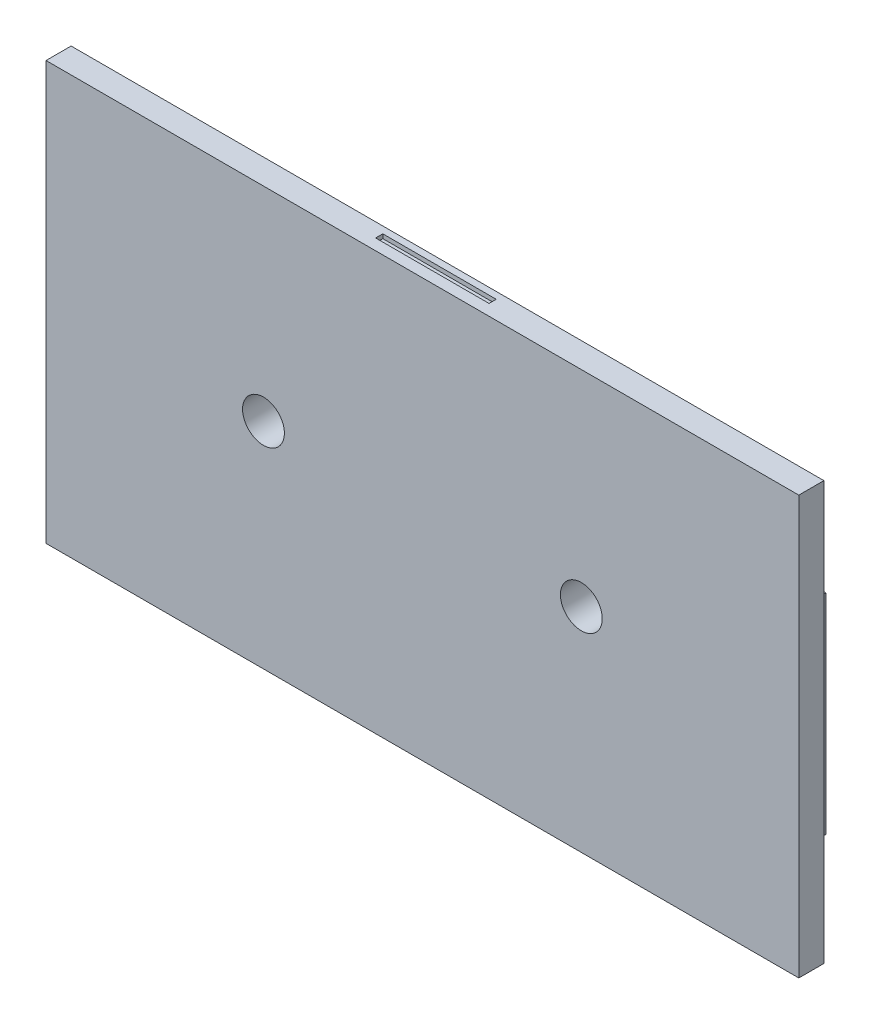
ISO-10303-21;
HEADER;
FILE_DESCRIPTION(('STEP AP214'),'2;1');
FILE_NAME('part.step','',(''),(''),'','','');
FILE_SCHEMA(('AUTOMOTIVE_DESIGN { 1 0 10303 214 1 1 1 1 }'));
ENDSEC;
DATA;
#1=APPLICATION_CONTEXT('core data for automotive mechanical design processes');
#2=APPLICATION_PROTOCOL_DEFINITION('international standard','automotive_design',2000,#1);
#3=PRODUCT_CONTEXT('',#1,'mechanical');
#4=PRODUCT('Part','Part','',(#3));
#5=PRODUCT_RELATED_PRODUCT_CATEGORY('part','',(#4));
#6=PRODUCT_DEFINITION_FORMATION('','',#4);
#7=PRODUCT_DEFINITION_CONTEXT('part definition',#1,'design');
#8=PRODUCT_DEFINITION('design','',#6,#7);
#9=PRODUCT_DEFINITION_SHAPE('','',#8);
#10=(LENGTH_UNIT() NAMED_UNIT(*) SI_UNIT(.MILLI.,.METRE.));
#11=(NAMED_UNIT(*) PLANE_ANGLE_UNIT() SI_UNIT($,.RADIAN.));
#12=(NAMED_UNIT(*) SI_UNIT($,.STERADIAN.) SOLID_ANGLE_UNIT());
#13=UNCERTAINTY_MEASURE_WITH_UNIT(LENGTH_MEASURE(1.E-05),#10,'distance_accuracy_value','');
#14=(GEOMETRIC_REPRESENTATION_CONTEXT(3) GLOBAL_UNCERTAINTY_ASSIGNED_CONTEXT((#13)) GLOBAL_UNIT_ASSIGNED_CONTEXT((#10,
#11,#12)) REPRESENTATION_CONTEXT('',''));
#15=CARTESIAN_POINT('',(0.,0.,0.));
#16=DIRECTION('',(0.,0.,1.));
#17=DIRECTION('',(1.,0.,0.));
#18=AXIS2_PLACEMENT_3D('',#15,#16,#17);
#19=CARTESIAN_POINT('',(0.,0.,0.));
#20=DIRECTION('',(0.,0.,-1.));
#21=DIRECTION('',(-1.,0.,0.));
#22=AXIS2_PLACEMENT_3D('',#19,#20,#21);
#23=PLANE('',#22);
#24=DIRECTION('',(1.,0.,0.));
#25=VECTOR('',#24,1.);
#26=CARTESIAN_POINT('',(90.,-50.,0.));
#27=LINE('',#26,#25);
#28=CARTESIAN_POINT('',(-90.,-50.,0.));
#29=VERTEX_POINT('',#28);
#30=CARTESIAN_POINT('',(90.,-50.,0.));
#31=VERTEX_POINT('',#30);
#32=EDGE_CURVE('E381',#29,#31,#27,.T.);
#33=ORIENTED_EDGE('',*,*,#32,.F.);
#34=DIRECTION('',(0.,-1.,0.));
#35=VECTOR('',#34,1.);
#36=CARTESIAN_POINT('',(-90.,-50.,0.));
#37=LINE('',#36,#35);
#38=CARTESIAN_POINT('',(-90.,50.,0.));
#39=VERTEX_POINT('',#38);
#40=EDGE_CURVE('E386',#39,#29,#37,.T.);
#41=ORIENTED_EDGE('',*,*,#40,.F.);
#42=DIRECTION('',(-1.,0.,0.));
#43=VECTOR('',#42,1.);
#44=CARTESIAN_POINT('',(-90.,50.,0.));
#45=LINE('',#44,#43);
#46=CARTESIAN_POINT('',(90.,50.,0.));
#47=VERTEX_POINT('',#46);
#48=EDGE_CURVE('E402',#47,#39,#45,.T.);
#49=ORIENTED_EDGE('',*,*,#48,.F.);
#50=DIRECTION('',(0.,1.,0.));
#51=VECTOR('',#50,1.);
#52=CARTESIAN_POINT('',(90.,50.,0.));
#53=LINE('',#52,#51);
#54=EDGE_CURVE('E399',#31,#47,#53,.T.);
#55=ORIENTED_EDGE('',*,*,#54,.F.);
#56=EDGE_LOOP('',(#33,#41,#49,#55));
#57=FACE_BOUND('',#56,.T.);
#58=DIRECTION('',(0.,1.,0.));
#59=VECTOR('',#58,1.);
#60=CARTESIAN_POINT('',(85.,-45.,0.));
#61=LINE('',#60,#59);
#62=CARTESIAN_POINT('',(85.,-45.,0.));
#63=VERTEX_POINT('',#62);
#64=CARTESIAN_POINT('',(85.,45.,0.));
#65=VERTEX_POINT('',#64);
#66=EDGE_CURVE('E365',#63,#65,#61,.T.);
#67=ORIENTED_EDGE('',*,*,#66,.T.);
#68=DIRECTION('',(-1.,0.,0.));
#69=VECTOR('',#68,1.);
#70=CARTESIAN_POINT('',(85.,45.,0.));
#71=LINE('',#70,#69);
#72=CARTESIAN_POINT('',(-85.,45.,0.));
#73=VERTEX_POINT('',#72);
#74=EDGE_CURVE('E353',#65,#73,#71,.T.);
#75=ORIENTED_EDGE('',*,*,#74,.T.);
#76=DIRECTION('',(0.,-1.,0.));
#77=VECTOR('',#76,1.);
#78=CARTESIAN_POINT('',(-85.,45.,0.));
#79=LINE('',#78,#77);
#80=CARTESIAN_POINT('',(-85.,-45.,0.));
#81=VERTEX_POINT('',#80);
#82=EDGE_CURVE('E357',#73,#81,#79,.T.);
#83=ORIENTED_EDGE('',*,*,#82,.T.);
#84=DIRECTION('',(1.,0.,0.));
#85=VECTOR('',#84,1.);
#86=CARTESIAN_POINT('',(-85.,-45.,0.));
#87=LINE('',#86,#85);
#88=EDGE_CURVE('E361',#81,#63,#87,.T.);
#89=ORIENTED_EDGE('',*,*,#88,.T.);
#90=EDGE_LOOP('',(#67,#75,#83,#89));
#91=FACE_BOUND('',#90,.T.);
#92=DIRECTION('',(-1.,0.,0.));
#93=VECTOR('',#92,1.);
#94=CARTESIAN_POINT('',(88.5,-25.,0.));
#95=LINE('',#94,#93);
#96=CARTESIAN_POINT('',(88.5,-25.,0.));
#97=VERTEX_POINT('',#96);
#98=CARTESIAN_POINT('',(86.5,-25.,0.));
#99=VERTEX_POINT('',#98);
#100=EDGE_CURVE('E302',#97,#99,#95,.T.);
#101=ORIENTED_EDGE('',*,*,#100,.F.);
#102=DIRECTION('',(0.,-1.,0.));
#103=VECTOR('',#102,1.);
#104=CARTESIAN_POINT('',(88.5,25.,0.));
#105=LINE('',#104,#103);
#106=CARTESIAN_POINT('',(88.5,25.,0.));
#107=VERTEX_POINT('',#106);
#108=EDGE_CURVE('E283',#107,#97,#105,.T.);
#109=ORIENTED_EDGE('',*,*,#108,.F.);
#110=DIRECTION('',(1.,0.,0.));
#111=VECTOR('',#110,1.);
#112=CARTESIAN_POINT('',(88.5,25.,0.));
#113=LINE('',#112,#111);
#114=CARTESIAN_POINT('',(86.5,25.,0.));
#115=VERTEX_POINT('',#114);
#116=EDGE_CURVE('E289',#115,#107,#113,.T.);
#117=ORIENTED_EDGE('',*,*,#116,.F.);
#118=DIRECTION('',(0.,1.,0.));
#119=VECTOR('',#118,1.);
#120=CARTESIAN_POINT('',(86.5,25.,0.));
#121=LINE('',#120,#119);
#122=EDGE_CURVE('E305',#99,#115,#121,.T.);
#123=ORIENTED_EDGE('',*,*,#122,.F.);
#124=EDGE_LOOP('',(#101,#109,#117,#123));
#125=FACE_BOUND('',#124,.T.);
#126=DIRECTION('',(-1.,0.,0.));
#127=VECTOR('',#126,1.);
#128=CARTESIAN_POINT('',(-88.5,25.,0.));
#129=LINE('',#128,#127);
#130=CARTESIAN_POINT('',(-86.5,25.,0.));
#131=VERTEX_POINT('',#130);
#132=CARTESIAN_POINT('',(-88.5,25.,0.));
#133=VERTEX_POINT('',#132);
#134=EDGE_CURVE('E242',#131,#133,#129,.T.);
#135=ORIENTED_EDGE('',*,*,#134,.T.);
#136=DIRECTION('',(0.,-1.,0.));
#137=VECTOR('',#136,1.);
#138=CARTESIAN_POINT('',(-88.5,25.,0.));
#139=LINE('',#138,#137);
#140=CARTESIAN_POINT('',(-88.5,-25.,0.));
#141=VERTEX_POINT('',#140);
#142=EDGE_CURVE('E69',#133,#141,#139,.T.);
#143=ORIENTED_EDGE('',*,*,#142,.T.);
#144=DIRECTION('',(1.,0.,0.));
#145=VECTOR('',#144,1.);
#146=CARTESIAN_POINT('',(-88.5,-25.,0.));
#147=LINE('',#146,#145);
#148=CARTESIAN_POINT('',(-86.5,-25.,0.));
#149=VERTEX_POINT('',#148);
#150=EDGE_CURVE('E274',#141,#149,#147,.T.);
#151=ORIENTED_EDGE('',*,*,#150,.T.);
#152=DIRECTION('',(0.,1.,0.));
#153=VECTOR('',#152,1.);
#154=CARTESIAN_POINT('',(-86.5,25.,0.));
#155=LINE('',#154,#153);
#156=EDGE_CURVE('E267',#149,#131,#155,.T.);
#157=ORIENTED_EDGE('',*,*,#156,.T.);
#158=EDGE_LOOP('',(#135,#143,#151,#157));
#159=FACE_BOUND('',#158,.T.);
#160=ADVANCED_FACE('F45',(#57,#91,#125,#159),#23,.T.);
#161=CARTESIAN_POINT('',(85.,45.,6.));
#162=DIRECTION('',(0.,-1.,0.));
#163=DIRECTION('',(1.,0.,0.));
#164=AXIS2_PLACEMENT_3D('',#161,#162,#163);
#165=PLANE('',#164);
#166=DIRECTION('',(0.,0.,-1.));
#167=VECTOR('',#166,1.);
#168=CARTESIAN_POINT('',(85.,45.,6.));
#169=LINE('',#168,#167);
#170=CARTESIAN_POINT('',(85.,45.,5.15));
#171=VERTEX_POINT('',#170);
#172=EDGE_CURVE('E369',#171,#65,#169,.T.);
#173=ORIENTED_EDGE('',*,*,#172,.F.);
#174=DIRECTION('',(-1.,0.,0.));
#175=VECTOR('',#174,1.);
#176=CARTESIAN_POINT('',(85.,45.,5.15));
#177=LINE('',#176,#175);
#178=CARTESIAN_POINT('',(-85.,45.,5.15));
#179=VERTEX_POINT('',#178);
#180=EDGE_CURVE('E349',#171,#179,#177,.T.);
#181=ORIENTED_EDGE('',*,*,#180,.T.);
#182=DIRECTION('',(0.,0.,-1.));
#183=VECTOR('',#182,1.);
#184=CARTESIAN_POINT('',(-85.,45.,6.));
#185=LINE('',#184,#183);
#186=EDGE_CURVE('E378',#179,#73,#185,.T.);
#187=ORIENTED_EDGE('',*,*,#186,.T.);
#188=ORIENTED_EDGE('',*,*,#74,.F.);
#189=EDGE_LOOP('',(#173,#181,#187,#188));
#190=FACE_BOUND('',#189,.T.);
#191=ADVANCED_FACE('F469',(#190),#165,.T.);
#192=CARTESIAN_POINT('',(-85.,45.,6.));
#193=DIRECTION('',(1.,0.,0.));
#194=DIRECTION('',(0.,0.,-1.));
#195=AXIS2_PLACEMENT_3D('',#192,#193,#194);
#196=PLANE('',#195);
#197=ORIENTED_EDGE('',*,*,#186,.F.);
#198=DIRECTION('',(0.,1.,0.));
#199=VECTOR('',#198,1.);
#200=CARTESIAN_POINT('',(-85.,50.,5.15));
#201=LINE('',#200,#199);
#202=CARTESIAN_POINT('',(-85.,-45.,5.14999999999999));
#203=VERTEX_POINT('',#202);
#204=EDGE_CURVE('E342',#203,#179,#201,.T.);
#205=ORIENTED_EDGE('',*,*,#204,.F.);
#206=DIRECTION('',(0.,0.,-1.));
#207=VECTOR('',#206,1.);
#208=CARTESIAN_POINT('',(-85.,-45.,6.));
#209=LINE('',#208,#207);
#210=EDGE_CURVE('E375',#203,#81,#209,.T.);
#211=ORIENTED_EDGE('',*,*,#210,.T.);
#212=ORIENTED_EDGE('',*,*,#82,.F.);
#213=EDGE_LOOP('',(#197,#205,#211,#212));
#214=FACE_BOUND('',#213,.T.);
#215=ADVANCED_FACE('F477',(#214),#196,.T.);
#216=CARTESIAN_POINT('',(-85.,-45.,6.));
#217=DIRECTION('',(0.,1.,0.));
#218=DIRECTION('',(-1.,0.,0.));
#219=AXIS2_PLACEMENT_3D('',#216,#217,#218);
#220=PLANE('',#219);
#221=ORIENTED_EDGE('',*,*,#210,.F.);
#222=DIRECTION('',(1.,0.,0.));
#223=VECTOR('',#222,1.);
#224=CARTESIAN_POINT('',(-85.,-45.,5.14999999999999));
#225=LINE('',#224,#223);
#226=CARTESIAN_POINT('',(85.,-45.,5.14999999999999));
#227=VERTEX_POINT('',#226);
#228=EDGE_CURVE('E345',#203,#227,#225,.T.);
#229=ORIENTED_EDGE('',*,*,#228,.T.);
#230=DIRECTION('',(0.,0.,-1.));
#231=VECTOR('',#230,1.);
#232=CARTESIAN_POINT('',(85.,-45.,6.));
#233=LINE('',#232,#231);
#234=EDGE_CURVE('E372',#227,#63,#233,.T.);
#235=ORIENTED_EDGE('',*,*,#234,.T.);
#236=ORIENTED_EDGE('',*,*,#88,.F.);
#237=EDGE_LOOP('',(#221,#229,#235,#236));
#238=FACE_BOUND('',#237,.T.);
#239=ADVANCED_FACE('F518',(#238),#220,.T.);
#240=CARTESIAN_POINT('',(85.,-45.,6.));
#241=DIRECTION('',(-1.,0.,0.));
#242=DIRECTION('',(0.,0.,1.));
#243=AXIS2_PLACEMENT_3D('',#240,#241,#242);
#244=PLANE('',#243);
#245=ORIENTED_EDGE('',*,*,#234,.F.);
#246=DIRECTION('',(0.,1.,0.));
#247=VECTOR('',#246,1.);
#248=CARTESIAN_POINT('',(85.,-45.,5.14999999999999));
#249=LINE('',#248,#247);
#250=EDGE_CURVE('E422',#227,#171,#249,.T.);
#251=ORIENTED_EDGE('',*,*,#250,.T.);
#252=ORIENTED_EDGE('',*,*,#172,.T.);
#253=ORIENTED_EDGE('',*,*,#66,.F.);
#254=EDGE_LOOP('',(#245,#251,#252,#253));
#255=FACE_BOUND('',#254,.T.);
#256=ADVANCED_FACE('F511',(#255),#244,.T.);
#257=CARTESIAN_POINT('',(0.,0.,6.));
#258=DIRECTION('',(0.,0.,-1.));
#259=DIRECTION('',(-1.,0.,0.));
#260=AXIS2_PLACEMENT_3D('',#257,#258,#259);
#261=PLANE('',#260);
#262=CARTESIAN_POINT('',(38.,0.899999999999983,6.));
#263=DIRECTION('',(0.,0.,-1.));
#264=DIRECTION('',(-1.,0.,0.));
#265=AXIS2_PLACEMENT_3D('',#262,#263,#264);
#266=CIRCLE('',#265,5.00000000000002);
#267=CARTESIAN_POINT('',(33.,0.899999999999983,6.));
#268=VERTEX_POINT('',#267);
#269=EDGE_CURVE('E330',#268,#268,#266,.T.);
#270=ORIENTED_EDGE('',*,*,#269,.T.);
#271=EDGE_LOOP('',(#270));
#272=FACE_BOUND('',#271,.T.);
#273=CARTESIAN_POINT('',(-38.,1.29999999999999,6.));
#274=DIRECTION('',(0.,0.,-1.));
#275=DIRECTION('',(-1.,0.,0.));
#276=AXIS2_PLACEMENT_3D('',#273,#274,#275);
#277=CIRCLE('',#276,5.);
#278=CARTESIAN_POINT('',(-43.,1.29999999999999,6.));
#279=VERTEX_POINT('',#278);
#280=EDGE_CURVE('E324',#279,#279,#277,.T.);
#281=ORIENTED_EDGE('',*,*,#280,.T.);
#282=EDGE_LOOP('',(#281));
#283=FACE_BOUND('',#282,.T.);
#284=DIRECTION('',(1.,0.,0.));
#285=VECTOR('',#284,1.);
#286=CARTESIAN_POINT('',(90.,-50.,6.));
#287=LINE('',#286,#285);
#288=CARTESIAN_POINT('',(-90.,-50.,6.));
#289=VERTEX_POINT('',#288);
#290=CARTESIAN_POINT('',(90.,-50.,6.));
#291=VERTEX_POINT('',#290);
#292=EDGE_CURVE('E382',#289,#291,#287,.T.);
#293=ORIENTED_EDGE('',*,*,#292,.T.);
#294=DIRECTION('',(0.,1.,0.));
#295=VECTOR('',#294,1.);
#296=CARTESIAN_POINT('',(90.,50.,6.));
#297=LINE('',#296,#295);
#298=CARTESIAN_POINT('',(90.,50.,6.));
#299=VERTEX_POINT('',#298);
#300=EDGE_CURVE('E385',#291,#299,#297,.T.);
#301=ORIENTED_EDGE('',*,*,#300,.T.);
#302=DIRECTION('',(-1.,0.,0.));
#303=VECTOR('',#302,1.);
#304=CARTESIAN_POINT('',(-90.,50.,6.));
#305=LINE('',#304,#303);
#306=CARTESIAN_POINT('',(-90.,50.,6.));
#307=VERTEX_POINT('',#306);
#308=EDGE_CURVE('E389',#299,#307,#305,.T.);
#309=ORIENTED_EDGE('',*,*,#308,.T.);
#310=DIRECTION('',(0.,-1.,0.));
#311=VECTOR('',#310,1.);
#312=CARTESIAN_POINT('',(-90.,-50.,6.));
#313=LINE('',#312,#311);
#314=EDGE_CURVE('E392',#307,#289,#313,.T.);
#315=ORIENTED_EDGE('',*,*,#314,.T.);
#316=EDGE_LOOP('',(#293,#301,#309,#315));
#317=FACE_BOUND('',#316,.T.);
#318=ADVANCED_FACE('F484',(#272,#283,#317),#261,.F.);
#319=CARTESIAN_POINT('',(90.,-50.,6.));
#320=DIRECTION('',(0.,1.,0.));
#321=DIRECTION('',(0.,0.,1.));
#322=AXIS2_PLACEMENT_3D('',#319,#320,#321);
#323=PLANE('',#322);
#324=DIRECTION('',(0.,0.,-1.));
#325=VECTOR('',#324,1.);
#326=CARTESIAN_POINT('',(90.,-50.,6.));
#327=LINE('',#326,#325);
#328=EDGE_CURVE('E418',#291,#31,#327,.T.);
#329=ORIENTED_EDGE('',*,*,#328,.F.);
#330=ORIENTED_EDGE('',*,*,#292,.F.);
#331=DIRECTION('',(0.,0.,-1.));
#332=VECTOR('',#331,1.);
#333=CARTESIAN_POINT('',(-90.,-50.,6.));
#334=LINE('',#333,#332);
#335=EDGE_CURVE('E395',#289,#29,#334,.T.);
#336=ORIENTED_EDGE('',*,*,#335,.T.);
#337=ORIENTED_EDGE('',*,*,#32,.T.);
#338=EDGE_LOOP('',(#329,#330,#336,#337));
#339=FACE_BOUND('',#338,.T.);
#340=ADVANCED_FACE('F47',(#339),#323,.F.);
#341=CARTESIAN_POINT('',(90.,50.,6.));
#342=DIRECTION('',(-1.,0.,0.));
#343=DIRECTION('',(0.,0.,1.));
#344=AXIS2_PLACEMENT_3D('',#341,#342,#343);
#345=PLANE('',#344);
#346=ORIENTED_EDGE('',*,*,#54,.T.);
#347=DIRECTION('',(0.,0.,-1.));
#348=VECTOR('',#347,1.);
#349=CARTESIAN_POINT('',(90.,50.,6.));
#350=LINE('',#349,#348);
#351=EDGE_CURVE('E414',#299,#47,#350,.T.);
#352=ORIENTED_EDGE('',*,*,#351,.F.);
#353=ORIENTED_EDGE('',*,*,#300,.F.);
#354=ORIENTED_EDGE('',*,*,#328,.T.);
#355=EDGE_LOOP('',(#346,#352,#353,#354));
#356=FACE_BOUND('',#355,.T.);
#357=ADVANCED_FACE('F490',(#356),#345,.F.);
#358=CARTESIAN_POINT('',(-90.,50.,6.));
#359=DIRECTION('',(0.,-1.,0.));
#360=DIRECTION('',(0.,0.,-1.));
#361=AXIS2_PLACEMENT_3D('',#358,#359,#360);
#362=PLANE('',#361);
#363=DIRECTION('',(1.,0.,0.));
#364=VECTOR('',#363,1.);
#365=CARTESIAN_POINT('',(13.2691884195042,50.,3.3433918285293));
#366=LINE('',#365,#364);
#367=CARTESIAN_POINT('',(-13.8419591426482,50.,3.3433918285293));
#368=VERTEX_POINT('',#367);
#369=CARTESIAN_POINT('',(13.2691884195042,50.,3.3433918285293));
#370=VERTEX_POINT('',#369);
#371=EDGE_CURVE('E220',#368,#370,#366,.T.);
#372=ORIENTED_EDGE('',*,*,#371,.F.);
#373=DIRECTION('',(0.,0.,1.));
#374=VECTOR('',#373,1.);
#375=CARTESIAN_POINT('',(-13.8419591426482,50.,3.3433918285293));
#376=LINE('',#375,#374);
#377=CARTESIAN_POINT('',(-13.8419591426482,50.,1.62507965909711));
#378=VERTEX_POINT('',#377);
#379=EDGE_CURVE('E61',#378,#368,#376,.T.);
#380=ORIENTED_EDGE('',*,*,#379,.F.);
#381=DIRECTION('',(-1.,0.,0.));
#382=VECTOR('',#381,1.);
#383=CARTESIAN_POINT('',(-13.8419591426482,50.,1.62507965909711));
#384=LINE('',#383,#382);
#385=CARTESIAN_POINT('',(13.2691884195042,50.,1.62507965909711));
#386=VERTEX_POINT('',#385);
#387=EDGE_CURVE('E207',#386,#378,#384,.T.);
#388=ORIENTED_EDGE('',*,*,#387,.F.);
#389=DIRECTION('',(0.,0.,-1.));
#390=VECTOR('',#389,1.);
#391=CARTESIAN_POINT('',(13.2691884195042,50.,1.62507965909711));
#392=LINE('',#391,#390);
#393=EDGE_CURVE('E211',#370,#386,#392,.T.);
#394=ORIENTED_EDGE('',*,*,#393,.F.);
#395=EDGE_LOOP('',(#372,#380,#388,#394));
#396=FACE_BOUND('',#395,.T.);
#397=DIRECTION('',(0.,0.,-1.));
#398=VECTOR('',#397,1.);
#399=CARTESIAN_POINT('',(-90.,50.,6.));
#400=LINE('',#399,#398);
#401=EDGE_CURVE('E410',#307,#39,#400,.T.);
#402=ORIENTED_EDGE('',*,*,#401,.F.);
#403=ORIENTED_EDGE('',*,*,#308,.F.);
#404=ORIENTED_EDGE('',*,*,#351,.T.);
#405=ORIENTED_EDGE('',*,*,#48,.T.);
#406=EDGE_LOOP('',(#402,#403,#404,#405));
#407=FACE_BOUND('',#406,.T.);
#408=ADVANCED_FACE('F487',(#396,#407),#362,.F.);
#409=CARTESIAN_POINT('',(-90.,-50.,6.));
#410=DIRECTION('',(1.,0.,0.));
#411=DIRECTION('',(0.,0.,-1.));
#412=AXIS2_PLACEMENT_3D('',#409,#410,#411);
#413=PLANE('',#412);
#414=ORIENTED_EDGE('',*,*,#40,.T.);
#415=ORIENTED_EDGE('',*,*,#335,.F.);
#416=ORIENTED_EDGE('',*,*,#314,.F.);
#417=ORIENTED_EDGE('',*,*,#401,.T.);
#418=EDGE_LOOP('',(#414,#415,#416,#417));
#419=FACE_BOUND('',#418,.T.);
#420=ADVANCED_FACE('F465',(#419),#413,.F.);
#421=CARTESIAN_POINT('',(185.003612434752,50.,5.15));
#422=DIRECTION('',(0.,0.,1.));
#423=DIRECTION('',(0.,-1.,0.));
#424=AXIS2_PLACEMENT_3D('',#421,#422,#423);
#425=PLANE('',#424);
#426=CARTESIAN_POINT('',(-38.,1.29999999999999,5.14999999999999));
#427=DIRECTION('',(0.,0.,1.));
#428=DIRECTION('',(0.,-1.,0.));
#429=AXIS2_PLACEMENT_3D('',#426,#427,#428);
#430=CIRCLE('',#429,12.5);
#431=CARTESIAN_POINT('',(-38.,-11.2,5.14999999999999));
#432=VERTEX_POINT('',#431);
#433=EDGE_CURVE('E430',#432,#432,#430,.F.);
#434=ORIENTED_EDGE('',*,*,#433,.F.);
#435=EDGE_LOOP('',(#434));
#436=FACE_BOUND('',#435,.T.);
#437=CARTESIAN_POINT('',(38.,0.899999999999983,5.14999999999999));
#438=DIRECTION('',(0.,0.,1.));
#439=DIRECTION('',(0.,-1.,0.));
#440=AXIS2_PLACEMENT_3D('',#437,#438,#439);
#441=CIRCLE('',#440,12.5);
#442=CARTESIAN_POINT('',(38.,-11.6,5.14999999999999));
#443=VERTEX_POINT('',#442);
#444=EDGE_CURVE('E426',#443,#443,#441,.F.);
#445=ORIENTED_EDGE('',*,*,#444,.F.);
#446=EDGE_LOOP('',(#445));
#447=FACE_BOUND('',#446,.T.);
#448=ORIENTED_EDGE('',*,*,#180,.F.);
#449=ORIENTED_EDGE('',*,*,#250,.F.);
#450=ORIENTED_EDGE('',*,*,#228,.F.);
#451=ORIENTED_EDGE('',*,*,#204,.T.);
#452=EDGE_LOOP('',(#448,#449,#450,#451));
#453=FACE_BOUND('',#452,.T.);
#454=ADVANCED_FACE('F456',(#436,#447,#453),#425,.F.);
#455=CARTESIAN_POINT('',(38.,0.899999999999985,-4.85000000000001));
#456=DIRECTION('',(0.,0.,-1.));
#457=DIRECTION('',(0.,1.,0.));
#458=AXIS2_PLACEMENT_3D('',#455,#456,#457);
#459=PLANE('',#458);
#460=CARTESIAN_POINT('',(38.,0.899999999999985,-4.85000000000001));
#461=DIRECTION('',(0.,0.,-1.));
#462=DIRECTION('',(0.,1.,0.));
#463=AXIS2_PLACEMENT_3D('',#460,#461,#462);
#464=CIRCLE('',#463,12.5);
#465=CARTESIAN_POINT('',(38.,13.4,-4.85));
#466=VERTEX_POINT('',#465);
#467=EDGE_CURVE('E338',#466,#466,#464,.T.);
#468=ORIENTED_EDGE('',*,*,#467,.T.);
#469=EDGE_LOOP('',(#468));
#470=FACE_BOUND('',#469,.T.);
#471=CARTESIAN_POINT('',(38.,0.899999999999985,-4.85000000000001));
#472=DIRECTION('',(0.,0.,-1.));
#473=DIRECTION('',(0.,1.,0.));
#474=AXIS2_PLACEMENT_3D('',#471,#472,#473);
#475=CIRCLE('',#474,9.24999999999999);
#476=CARTESIAN_POINT('',(38.,10.15,-4.85));
#477=VERTEX_POINT('',#476);
#478=EDGE_CURVE('E334',#477,#477,#475,.T.);
#479=ORIENTED_EDGE('',*,*,#478,.F.);
#480=EDGE_LOOP('',(#479));
#481=FACE_BOUND('',#480,.T.);
#482=ADVANCED_FACE('F454',(#470,#481),#459,.T.);
#483=CARTESIAN_POINT('',(38.,0.899999999999985,-4.85000000000001));
#484=DIRECTION('',(0.,0.,1.));
#485=DIRECTION('',(0.,-1.,0.));
#486=AXIS2_PLACEMENT_3D('',#483,#484,#485);
#487=CYLINDRICAL_SURFACE('',#486,12.5);
#488=ORIENTED_EDGE('',*,*,#467,.F.);
#489=EDGE_LOOP('',(#488));
#490=FACE_BOUND('',#489,.T.);
#491=ORIENTED_EDGE('',*,*,#444,.T.);
#492=EDGE_LOOP('',(#491));
#493=FACE_BOUND('',#492,.T.);
#494=ADVANCED_FACE('F450',(#490,#493),#487,.T.);
#495=CARTESIAN_POINT('',(38.,0.899999999999985,-4.85000000000001));
#496=DIRECTION('',(0.,0.,1.));
#497=DIRECTION('',(0.,-1.,0.));
#498=AXIS2_PLACEMENT_3D('',#495,#496,#497);
#499=CYLINDRICAL_SURFACE('',#498,9.24999999999999);
#500=CARTESIAN_POINT('',(38.,0.899999999999984,-3.35000000000001));
#501=DIRECTION('',(0.,0.,-1.));
#502=DIRECTION('',(0.,1.,0.));
#503=AXIS2_PLACEMENT_3D('',#500,#501,#502);
#504=CIRCLE('',#503,9.24999999999999);
#505=CARTESIAN_POINT('',(38.,10.15,-3.35000000000001));
#506=VERTEX_POINT('',#505);
#507=EDGE_CURVE('E54',#506,#506,#504,.T.);
#508=ORIENTED_EDGE('',*,*,#507,.F.);
#509=EDGE_LOOP('',(#508));
#510=FACE_BOUND('',#509,.T.);
#511=ORIENTED_EDGE('',*,*,#478,.T.);
#512=EDGE_LOOP('',(#511));
#513=FACE_BOUND('',#512,.T.);
#514=ADVANCED_FACE('F446',(#510,#513),#499,.F.);
#515=CARTESIAN_POINT('',(-38.,1.29999999999999,-4.85000000000001));
#516=DIRECTION('',(0.,0.,-1.));
#517=DIRECTION('',(0.,1.,0.));
#518=AXIS2_PLACEMENT_3D('',#515,#516,#517);
#519=PLANE('',#518);
#520=CARTESIAN_POINT('',(-38.,1.29999999999999,-4.85000000000001));
#521=DIRECTION('',(0.,0.,-1.));
#522=DIRECTION('',(0.,1.,0.));
#523=AXIS2_PLACEMENT_3D('',#520,#521,#522);
#524=CIRCLE('',#523,12.5);
#525=CARTESIAN_POINT('',(-38.,13.8,-4.85));
#526=VERTEX_POINT('',#525);
#527=EDGE_CURVE('E325',#526,#526,#524,.T.);
#528=ORIENTED_EDGE('',*,*,#527,.T.);
#529=EDGE_LOOP('',(#528));
#530=FACE_BOUND('',#529,.T.);
#531=CARTESIAN_POINT('',(-38.,1.29999999999999,-4.85000000000001));
#532=DIRECTION('',(0.,0.,-1.));
#533=DIRECTION('',(0.,1.,0.));
#534=AXIS2_PLACEMENT_3D('',#531,#532,#533);
#535=CIRCLE('',#534,9.24999999999999);
#536=CARTESIAN_POINT('',(-38.,10.55,-4.85));
#537=VERTEX_POINT('',#536);
#538=EDGE_CURVE('E329',#537,#537,#535,.T.);
#539=ORIENTED_EDGE('',*,*,#538,.F.);
#540=EDGE_LOOP('',(#539));
#541=FACE_BOUND('',#540,.T.);
#542=ADVANCED_FACE('F449',(#530,#541),#519,.T.);
#543=CARTESIAN_POINT('',(-38.,1.29999999999999,-4.85000000000001));
#544=DIRECTION('',(0.,0.,1.));
#545=DIRECTION('',(0.,-1.,0.));
#546=AXIS2_PLACEMENT_3D('',#543,#544,#545);
#547=CYLINDRICAL_SURFACE('',#546,12.5);
#548=ORIENTED_EDGE('',*,*,#527,.F.);
#549=EDGE_LOOP('',(#548));
#550=FACE_BOUND('',#549,.T.);
#551=ORIENTED_EDGE('',*,*,#433,.T.);
#552=EDGE_LOOP('',(#551));
#553=FACE_BOUND('',#552,.T.);
#554=ADVANCED_FACE('F585',(#550,#553),#547,.T.);
#555=CARTESIAN_POINT('',(-38.,1.29999999999999,-4.85000000000001));
#556=DIRECTION('',(0.,0.,1.));
#557=DIRECTION('',(0.,-1.,0.));
#558=AXIS2_PLACEMENT_3D('',#555,#556,#557);
#559=CYLINDRICAL_SURFACE('',#558,9.24999999999999);
#560=CARTESIAN_POINT('',(-38.,1.29999999999999,-3.35000000000001));
#561=DIRECTION('',(0.,0.,-1.));
#562=DIRECTION('',(0.,1.,0.));
#563=AXIS2_PLACEMENT_3D('',#560,#561,#562);
#564=CIRCLE('',#563,9.24999999999999);
#565=CARTESIAN_POINT('',(-38.,10.55,-3.35000000000001));
#566=VERTEX_POINT('',#565);
#567=EDGE_CURVE('E11',#566,#566,#564,.T.);
#568=ORIENTED_EDGE('',*,*,#567,.F.);
#569=EDGE_LOOP('',(#568));
#570=FACE_BOUND('',#569,.T.);
#571=ORIENTED_EDGE('',*,*,#538,.T.);
#572=EDGE_LOOP('',(#571));
#573=FACE_BOUND('',#572,.T.);
#574=ADVANCED_FACE('F529',(#570,#573),#559,.F.);
#575=CARTESIAN_POINT('',(-38.,1.29999999999999,35.15));
#576=DIRECTION('',(0.,0.,-1.));
#577=DIRECTION('',(0.,1.,0.));
#578=AXIS2_PLACEMENT_3D('',#575,#576,#577);
#579=CYLINDRICAL_SURFACE('',#578,5.);
#580=ORIENTED_EDGE('',*,*,#280,.F.);
#581=EDGE_LOOP('',(#580));
#582=FACE_BOUND('',#581,.T.);
#583=CARTESIAN_POINT('',(-38.,1.29999999999999,-3.35000000000001));
#584=DIRECTION('',(0.,0.,-1.));
#585=DIRECTION('',(0.,1.,0.));
#586=AXIS2_PLACEMENT_3D('',#583,#584,#585);
#587=CIRCLE('',#586,5.);
#588=CARTESIAN_POINT('',(-38.,6.29999999999999,-3.35000000000001));
#589=VERTEX_POINT('',#588);
#590=EDGE_CURVE('E229',#589,#589,#587,.T.);
#591=ORIENTED_EDGE('',*,*,#590,.T.);
#592=EDGE_LOOP('',(#591));
#593=FACE_BOUND('',#592,.T.);
#594=ADVANCED_FACE('F525',(#582,#593),#579,.F.);
#595=CARTESIAN_POINT('',(38.,0.89999999999998,35.15));
#596=DIRECTION('',(0.,0.,-1.));
#597=DIRECTION('',(0.,1.,0.));
#598=AXIS2_PLACEMENT_3D('',#595,#596,#597);
#599=CYLINDRICAL_SURFACE('',#598,5.00000000000002);
#600=ORIENTED_EDGE('',*,*,#269,.F.);
#601=EDGE_LOOP('',(#600));
#602=FACE_BOUND('',#601,.T.);
#603=CARTESIAN_POINT('',(38.,0.899999999999985,-3.35000000000001));
#604=DIRECTION('',(0.,0.,-1.));
#605=DIRECTION('',(0.,1.,0.));
#606=AXIS2_PLACEMENT_3D('',#603,#604,#605);
#607=CIRCLE('',#606,5.00000000000002);
#608=CARTESIAN_POINT('',(38.,5.9,-3.35000000000001));
#609=VERTEX_POINT('',#608);
#610=EDGE_CURVE('E238',#609,#609,#607,.T.);
#611=ORIENTED_EDGE('',*,*,#610,.T.);
#612=EDGE_LOOP('',(#611));
#613=FACE_BOUND('',#612,.T.);
#614=ADVANCED_FACE('F528',(#602,#613),#599,.F.);
#615=CARTESIAN_POINT('',(88.5,25.,-2.));
#616=DIRECTION('',(-1.,0.,0.));
#617=DIRECTION('',(0.,0.,1.));
#618=AXIS2_PLACEMENT_3D('',#615,#616,#617);
#619=PLANE('',#618);
#620=ORIENTED_EDGE('',*,*,#108,.T.);
#621=DIRECTION('',(0.,0.,1.));
#622=VECTOR('',#621,1.);
#623=CARTESIAN_POINT('',(88.5,-25.,-2.));
#624=LINE('',#623,#622);
#625=CARTESIAN_POINT('',(88.5,-25.,-2.));
#626=VERTEX_POINT('',#625);
#627=EDGE_CURVE('E321',#626,#97,#624,.T.);
#628=ORIENTED_EDGE('',*,*,#627,.F.);
#629=DIRECTION('',(0.,-1.,0.));
#630=VECTOR('',#629,1.);
#631=CARTESIAN_POINT('',(88.5,25.,-2.));
#632=LINE('',#631,#630);
#633=CARTESIAN_POINT('',(88.5,25.,-2.));
#634=VERTEX_POINT('',#633);
#635=EDGE_CURVE('E284',#634,#626,#632,.T.);
#636=ORIENTED_EDGE('',*,*,#635,.F.);
#637=DIRECTION('',(0.,0.,1.));
#638=VECTOR('',#637,1.);
#639=CARTESIAN_POINT('',(88.5,25.,-2.));
#640=LINE('',#639,#638);
#641=EDGE_CURVE('E298',#634,#107,#640,.T.);
#642=ORIENTED_EDGE('',*,*,#641,.T.);
#643=EDGE_LOOP('',(#620,#628,#636,#642));
#644=FACE_BOUND('',#643,.T.);
#645=ADVANCED_FACE('F578',(#644),#619,.F.);
#646=CARTESIAN_POINT('',(88.5,-25.,-2.));
#647=DIRECTION('',(0.,1.,0.));
#648=DIRECTION('',(0.,0.,1.));
#649=AXIS2_PLACEMENT_3D('',#646,#647,#648);
#650=PLANE('',#649);
#651=ORIENTED_EDGE('',*,*,#100,.T.);
#652=DIRECTION('',(0.,0.,1.));
#653=VECTOR('',#652,1.);
#654=CARTESIAN_POINT('',(86.5,-25.,-2.));
#655=LINE('',#654,#653);
#656=CARTESIAN_POINT('',(86.5,-25.,-2.));
#657=VERTEX_POINT('',#656);
#658=EDGE_CURVE('E317',#657,#99,#655,.T.);
#659=ORIENTED_EDGE('',*,*,#658,.F.);
#660=DIRECTION('',(-1.,0.,0.));
#661=VECTOR('',#660,1.);
#662=CARTESIAN_POINT('',(88.5,-25.,-2.));
#663=LINE('',#662,#661);
#664=EDGE_CURVE('E288',#626,#657,#663,.T.);
#665=ORIENTED_EDGE('',*,*,#664,.F.);
#666=ORIENTED_EDGE('',*,*,#627,.T.);
#667=EDGE_LOOP('',(#651,#659,#665,#666));
#668=FACE_BOUND('',#667,.T.);
#669=ADVANCED_FACE('F574',(#668),#650,.F.);
#670=CARTESIAN_POINT('',(86.5,25.,-2.));
#671=DIRECTION('',(1.,0.,0.));
#672=DIRECTION('',(0.,0.,-1.));
#673=AXIS2_PLACEMENT_3D('',#670,#671,#672);
#674=PLANE('',#673);
#675=ORIENTED_EDGE('',*,*,#122,.T.);
#676=DIRECTION('',(0.,0.,1.));
#677=VECTOR('',#676,1.);
#678=CARTESIAN_POINT('',(86.5,25.,-2.));
#679=LINE('',#678,#677);
#680=CARTESIAN_POINT('',(86.5,25.,-2.));
#681=VERTEX_POINT('',#680);
#682=EDGE_CURVE('E314',#681,#115,#679,.T.);
#683=ORIENTED_EDGE('',*,*,#682,.F.);
#684=DIRECTION('',(0.,1.,0.));
#685=VECTOR('',#684,1.);
#686=CARTESIAN_POINT('',(86.5,25.,-2.));
#687=LINE('',#686,#685);
#688=EDGE_CURVE('E292',#657,#681,#687,.T.);
#689=ORIENTED_EDGE('',*,*,#688,.F.);
#690=ORIENTED_EDGE('',*,*,#658,.T.);
#691=EDGE_LOOP('',(#675,#683,#689,#690));
#692=FACE_BOUND('',#691,.T.);
#693=ADVANCED_FACE('F570',(#692),#674,.F.);
#694=CARTESIAN_POINT('',(88.5,25.,-2.));
#695=DIRECTION('',(0.,-1.,0.));
#696=DIRECTION('',(0.,0.,-1.));
#697=AXIS2_PLACEMENT_3D('',#694,#695,#696);
#698=PLANE('',#697);
#699=ORIENTED_EDGE('',*,*,#116,.T.);
#700=ORIENTED_EDGE('',*,*,#641,.F.);
#701=DIRECTION('',(1.,0.,0.));
#702=VECTOR('',#701,1.);
#703=CARTESIAN_POINT('',(88.5,25.,-2.));
#704=LINE('',#703,#702);
#705=EDGE_CURVE('E295',#681,#634,#704,.T.);
#706=ORIENTED_EDGE('',*,*,#705,.F.);
#707=ORIENTED_EDGE('',*,*,#682,.T.);
#708=EDGE_LOOP('',(#699,#700,#706,#707));
#709=FACE_BOUND('',#708,.T.);
#710=ADVANCED_FACE('F566',(#709),#698,.F.);
#711=CARTESIAN_POINT('',(0.,0.,-2.));
#712=DIRECTION('',(0.,0.,-1.));
#713=DIRECTION('',(-1.,0.,0.));
#714=AXIS2_PLACEMENT_3D('',#711,#712,#713);
#715=PLANE('',#714);
#716=ORIENTED_EDGE('',*,*,#635,.T.);
#717=ORIENTED_EDGE('',*,*,#664,.T.);
#718=ORIENTED_EDGE('',*,*,#688,.T.);
#719=ORIENTED_EDGE('',*,*,#705,.T.);
#720=EDGE_LOOP('',(#716,#717,#718,#719));
#721=FACE_BOUND('',#720,.T.);
#722=ADVANCED_FACE('F564',(#721),#715,.T.);
#723=CARTESIAN_POINT('',(-88.5,25.,-2.));
#724=DIRECTION('',(1.,0.,0.));
#725=DIRECTION('',(0.,0.,1.));
#726=AXIS2_PLACEMENT_3D('',#723,#724,#725);
#727=PLANE('',#726);
#728=ORIENTED_EDGE('',*,*,#142,.F.);
#729=DIRECTION('',(0.,0.,1.));
#730=VECTOR('',#729,1.);
#731=CARTESIAN_POINT('',(-88.5,25.,-2.));
#732=LINE('',#731,#730);
#733=CARTESIAN_POINT('',(-88.5,25.,-2.));
#734=VERTEX_POINT('',#733);
#735=EDGE_CURVE('E261',#734,#133,#732,.T.);
#736=ORIENTED_EDGE('',*,*,#735,.F.);
#737=DIRECTION('',(0.,-1.,0.));
#738=VECTOR('',#737,1.);
#739=CARTESIAN_POINT('',(-88.5,25.,-2.));
#740=LINE('',#739,#738);
#741=CARTESIAN_POINT('',(-88.5,-25.,-2.));
#742=VERTEX_POINT('',#741);
#743=EDGE_CURVE('E246',#734,#742,#740,.T.);
#744=ORIENTED_EDGE('',*,*,#743,.T.);
#745=DIRECTION('',(0.,0.,1.));
#746=VECTOR('',#745,1.);
#747=CARTESIAN_POINT('',(-88.5,-25.,-2.));
#748=LINE('',#747,#746);
#749=EDGE_CURVE('E278',#742,#141,#748,.T.);
#750=ORIENTED_EDGE('',*,*,#749,.T.);
#751=EDGE_LOOP('',(#728,#736,#744,#750));
#752=FACE_BOUND('',#751,.T.);
#753=ADVANCED_FACE('F561',(#752),#727,.F.);
#754=CARTESIAN_POINT('',(-88.5,-25.,-2.));
#755=DIRECTION('',(0.,1.,0.));
#756=DIRECTION('',(0.,0.,1.));
#757=AXIS2_PLACEMENT_3D('',#754,#755,#756);
#758=PLANE('',#757);
#759=ORIENTED_EDGE('',*,*,#150,.F.);
#760=ORIENTED_EDGE('',*,*,#749,.F.);
#761=DIRECTION('',(1.,0.,0.));
#762=VECTOR('',#761,1.);
#763=CARTESIAN_POINT('',(-88.5,-25.,-2.));
#764=LINE('',#763,#762);
#765=CARTESIAN_POINT('',(-86.5,-25.,-2.));
#766=VERTEX_POINT('',#765);
#767=EDGE_CURVE('E250',#742,#766,#764,.T.);
#768=ORIENTED_EDGE('',*,*,#767,.T.);
#769=DIRECTION('',(0.,0.,1.));
#770=VECTOR('',#769,1.);
#771=CARTESIAN_POINT('',(-86.5,-25.,-2.));
#772=LINE('',#771,#770);
#773=EDGE_CURVE('E271',#766,#149,#772,.T.);
#774=ORIENTED_EDGE('',*,*,#773,.T.);
#775=EDGE_LOOP('',(#759,#760,#768,#774));
#776=FACE_BOUND('',#775,.T.);
#777=ADVANCED_FACE('F557',(#776),#758,.F.);
#778=CARTESIAN_POINT('',(-86.5,25.,-2.));
#779=DIRECTION('',(-1.,0.,0.));
#780=DIRECTION('',(0.,0.,-1.));
#781=AXIS2_PLACEMENT_3D('',#778,#779,#780);
#782=PLANE('',#781);
#783=ORIENTED_EDGE('',*,*,#156,.F.);
#784=ORIENTED_EDGE('',*,*,#773,.F.);
#785=DIRECTION('',(0.,1.,0.));
#786=VECTOR('',#785,1.);
#787=CARTESIAN_POINT('',(-86.5,25.,-2.));
#788=LINE('',#787,#786);
#789=CARTESIAN_POINT('',(-86.5,25.,-2.));
#790=VERTEX_POINT('',#789);
#791=EDGE_CURVE('E254',#766,#790,#788,.T.);
#792=ORIENTED_EDGE('',*,*,#791,.T.);
#793=DIRECTION('',(0.,0.,1.));
#794=VECTOR('',#793,1.);
#795=CARTESIAN_POINT('',(-86.5,25.,-2.));
#796=LINE('',#795,#794);
#797=EDGE_CURVE('E264',#790,#131,#796,.T.);
#798=ORIENTED_EDGE('',*,*,#797,.T.);
#799=EDGE_LOOP('',(#783,#784,#792,#798));
#800=FACE_BOUND('',#799,.T.);
#801=ADVANCED_FACE('F553',(#800),#782,.F.);
#802=CARTESIAN_POINT('',(-88.5,25.,-2.));
#803=DIRECTION('',(0.,-1.,0.));
#804=DIRECTION('',(0.,0.,-1.));
#805=AXIS2_PLACEMENT_3D('',#802,#803,#804);
#806=PLANE('',#805);
#807=ORIENTED_EDGE('',*,*,#134,.F.);
#808=ORIENTED_EDGE('',*,*,#797,.F.);
#809=DIRECTION('',(-1.,0.,0.));
#810=VECTOR('',#809,1.);
#811=CARTESIAN_POINT('',(-88.5,25.,-2.));
#812=LINE('',#811,#810);
#813=EDGE_CURVE('E258',#790,#734,#812,.T.);
#814=ORIENTED_EDGE('',*,*,#813,.T.);
#815=ORIENTED_EDGE('',*,*,#735,.T.);
#816=EDGE_LOOP('',(#807,#808,#814,#815));
#817=FACE_BOUND('',#816,.T.);
#818=ADVANCED_FACE('F549',(#817),#806,.F.);
#819=CARTESIAN_POINT('',(0.,0.,-2.));
#820=DIRECTION('',(0.,0.,-1.));
#821=DIRECTION('',(1.,0.,0.));
#822=AXIS2_PLACEMENT_3D('',#819,#820,#821);
#823=PLANE('',#822);
#824=ORIENTED_EDGE('',*,*,#743,.F.);
#825=ORIENTED_EDGE('',*,*,#813,.F.);
#826=ORIENTED_EDGE('',*,*,#791,.F.);
#827=ORIENTED_EDGE('',*,*,#767,.F.);
#828=EDGE_LOOP('',(#824,#825,#826,#827));
#829=FACE_BOUND('',#828,.T.);
#830=ADVANCED_FACE('F543',(#829),#823,.T.);
#831=CARTESIAN_POINT('',(38.,0.899999999999985,-3.35000000000001));
#832=DIRECTION('',(0.,0.,-1.));
#833=DIRECTION('',(0.,1.,0.));
#834=AXIS2_PLACEMENT_3D('',#831,#832,#833);
#835=PLANE('',#834);
#836=ORIENTED_EDGE('',*,*,#507,.T.);
#837=EDGE_LOOP('',(#836));
#838=FACE_BOUND('',#837,.T.);
#839=ORIENTED_EDGE('',*,*,#610,.F.);
#840=EDGE_LOOP('',(#839));
#841=FACE_BOUND('',#840,.T.);
#842=ADVANCED_FACE('F443',(#838,#841),#835,.T.);
#843=CARTESIAN_POINT('',(-38.,1.29999999999999,-3.35000000000001));
#844=DIRECTION('',(0.,0.,-1.));
#845=DIRECTION('',(0.,1.,0.));
#846=AXIS2_PLACEMENT_3D('',#843,#844,#845);
#847=PLANE('',#846);
#848=ORIENTED_EDGE('',*,*,#567,.T.);
#849=EDGE_LOOP('',(#848));
#850=FACE_BOUND('',#849,.T.);
#851=ORIENTED_EDGE('',*,*,#590,.F.);
#852=EDGE_LOOP('',(#851));
#853=FACE_BOUND('',#852,.T.);
#854=ADVANCED_FACE('F533',(#850,#853),#847,.T.);
#855=CARTESIAN_POINT('',(-13.8419591426482,49.,3.3433918285293));
#856=DIRECTION('',(-1.,0.,0.));
#857=DIRECTION('',(0.,0.,1.));
#858=AXIS2_PLACEMENT_3D('',#855,#856,#857);
#859=PLANE('',#858);
#860=ORIENTED_EDGE('',*,*,#379,.T.);
#861=DIRECTION('',(0.,1.,0.));
#862=VECTOR('',#861,1.);
#863=CARTESIAN_POINT('',(-13.8419591426482,49.,3.3433918285293));
#864=LINE('',#863,#862);
#865=CARTESIAN_POINT('',(-13.8419591426482,49.,3.3433918285293));
#866=VERTEX_POINT('',#865);
#867=EDGE_CURVE('E182',#866,#368,#864,.T.);
#868=ORIENTED_EDGE('',*,*,#867,.F.);
#869=DIRECTION('',(0.,0.,1.));
#870=VECTOR('',#869,1.);
#871=CARTESIAN_POINT('',(-13.8419591426482,49.,3.3433918285293));
#872=LINE('',#871,#870);
#873=CARTESIAN_POINT('',(-13.8419591426482,49.,1.62507965909711));
#874=VERTEX_POINT('',#873);
#875=EDGE_CURVE('E186',#874,#866,#872,.T.);
#876=ORIENTED_EDGE('',*,*,#875,.F.);
#877=DIRECTION('',(0.,1.,0.));
#878=VECTOR('',#877,1.);
#879=CARTESIAN_POINT('',(-13.8419591426482,49.,1.62507965909711));
#880=LINE('',#879,#878);
#881=EDGE_CURVE('E226',#874,#378,#880,.T.);
#882=ORIENTED_EDGE('',*,*,#881,.T.);
#883=EDGE_LOOP('',(#860,#868,#876,#882));
#884=FACE_BOUND('',#883,.T.);
#885=ADVANCED_FACE('F184',(#884),#859,.F.);
#886=CARTESIAN_POINT('',(-13.8419591426482,49.,1.62507965909711));
#887=DIRECTION('',(0.,0.,-1.));
#888=DIRECTION('',(-1.,0.,0.));
#889=AXIS2_PLACEMENT_3D('',#886,#887,#888);
#890=PLANE('',#889);
#891=ORIENTED_EDGE('',*,*,#387,.T.);
#892=ORIENTED_EDGE('',*,*,#881,.F.);
#893=DIRECTION('',(-1.,0.,0.));
#894=VECTOR('',#893,1.);
#895=CARTESIAN_POINT('',(-13.8419591426482,49.,1.62507965909711));
#896=LINE('',#895,#894);
#897=CARTESIAN_POINT('',(13.2691884195042,49.,1.62507965909711));
#898=VERTEX_POINT('',#897);
#899=EDGE_CURVE('E193',#898,#874,#896,.T.);
#900=ORIENTED_EDGE('',*,*,#899,.F.);
#901=DIRECTION('',(0.,1.,0.));
#902=VECTOR('',#901,1.);
#903=CARTESIAN_POINT('',(13.2691884195042,49.,1.62507965909711));
#904=LINE('',#903,#902);
#905=EDGE_CURVE('E230',#898,#386,#904,.T.);
#906=ORIENTED_EDGE('',*,*,#905,.T.);
#907=EDGE_LOOP('',(#891,#892,#900,#906));
#908=FACE_BOUND('',#907,.T.);
#909=ADVANCED_FACE('F540',(#908),#890,.F.);
#910=CARTESIAN_POINT('',(13.2691884195042,49.,1.62507965909711));
#911=DIRECTION('',(1.,0.,0.));
#912=DIRECTION('',(0.,0.,-1.));
#913=AXIS2_PLACEMENT_3D('',#910,#911,#912);
#914=PLANE('',#913);
#915=ORIENTED_EDGE('',*,*,#393,.T.);
#916=ORIENTED_EDGE('',*,*,#905,.F.);
#917=DIRECTION('',(0.,0.,-1.));
#918=VECTOR('',#917,1.);
#919=CARTESIAN_POINT('',(13.2691884195042,49.,1.62507965909711));
#920=LINE('',#919,#918);
#921=CARTESIAN_POINT('',(13.2691884195042,49.,3.3433918285293));
#922=VERTEX_POINT('',#921);
#923=EDGE_CURVE('E202',#922,#898,#920,.T.);
#924=ORIENTED_EDGE('',*,*,#923,.F.);
#925=DIRECTION('',(0.,1.,0.));
#926=VECTOR('',#925,1.);
#927=CARTESIAN_POINT('',(13.2691884195042,49.,3.3433918285293));
#928=LINE('',#927,#926);
#929=EDGE_CURVE('E192',#922,#370,#928,.T.);
#930=ORIENTED_EDGE('',*,*,#929,.T.);
#931=EDGE_LOOP('',(#915,#916,#924,#930));
#932=FACE_BOUND('',#931,.T.);
#933=ADVANCED_FACE('F634',(#932),#914,.F.);
#934=CARTESIAN_POINT('',(13.2691884195042,49.,3.3433918285293));
#935=DIRECTION('',(0.,0.,1.));
#936=DIRECTION('',(1.,0.,0.));
#937=AXIS2_PLACEMENT_3D('',#934,#935,#936);
#938=PLANE('',#937);
#939=ORIENTED_EDGE('',*,*,#371,.T.);
#940=ORIENTED_EDGE('',*,*,#929,.F.);
#941=DIRECTION('',(1.,0.,0.));
#942=VECTOR('',#941,1.);
#943=CARTESIAN_POINT('',(13.2691884195042,49.,3.3433918285293));
#944=LINE('',#943,#942);
#945=EDGE_CURVE('E196',#866,#922,#944,.T.);
#946=ORIENTED_EDGE('',*,*,#945,.F.);
#947=ORIENTED_EDGE('',*,*,#867,.T.);
#948=EDGE_LOOP('',(#939,#940,#946,#947));
#949=FACE_BOUND('',#948,.T.);
#950=ADVANCED_FACE('F197',(#949),#938,.F.);
#951=CARTESIAN_POINT('',(0.,49.,0.));
#952=DIRECTION('',(0.,-1.,0.));
#953=DIRECTION('',(0.,0.,-1.));
#954=AXIS2_PLACEMENT_3D('',#951,#952,#953);
#955=PLANE('',#954);
#956=ORIENTED_EDGE('',*,*,#875,.T.);
#957=ORIENTED_EDGE('',*,*,#945,.T.);
#958=ORIENTED_EDGE('',*,*,#923,.T.);
#959=ORIENTED_EDGE('',*,*,#899,.T.);
#960=EDGE_LOOP('',(#956,#957,#958,#959));
#961=FACE_BOUND('',#960,.T.);
#962=ADVANCED_FACE('F204',(#961),#955,.F.);
#963=CLOSED_SHELL('',(#160,#191,#215,#239,#256,#318,#340,#357,#408,#420,#454,#482,#494,#514,
#542,#554,#574,#594,#614,#645,#669,#693,#710,#722,#753,#777,#801,#818,#830,#842,#854,#885,#909,
#933,#950,#962));
#964=MANIFOLD_SOLID_BREP('B2',#963);
#965=ADVANCED_BREP_SHAPE_REPRESENTATION('',(#18,#964),#14);
#966=SHAPE_DEFINITION_REPRESENTATION(#9,#965);
ENDSEC;
END-ISO-10303-21;
